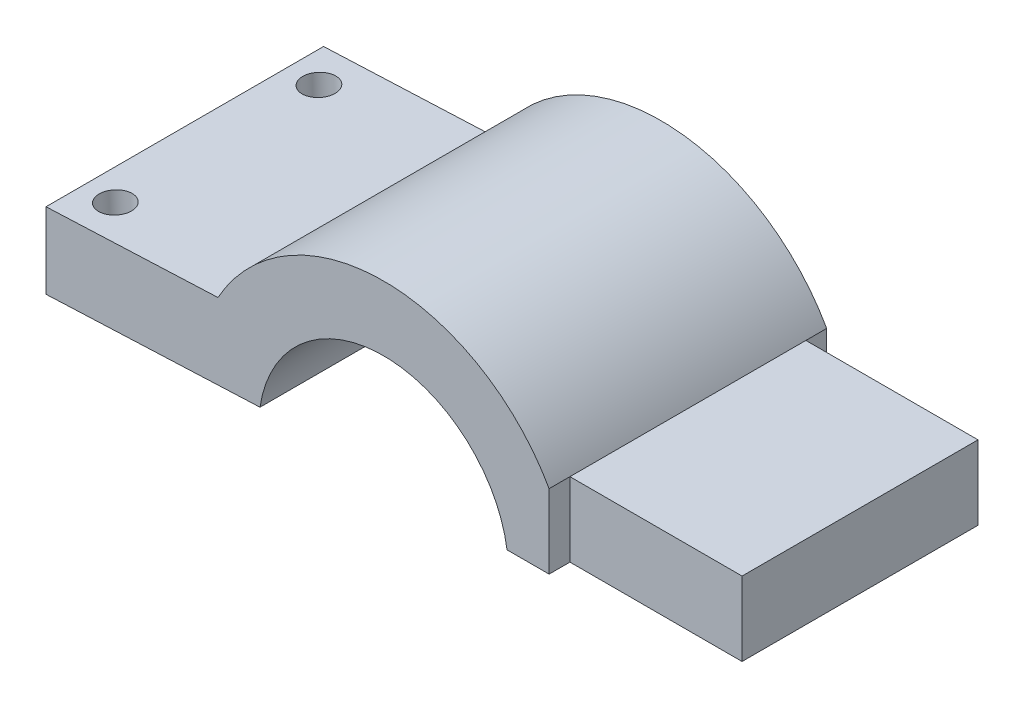
ISO-10303-21;
HEADER;
FILE_DESCRIPTION(('STEP AP214'),'2;1');
FILE_NAME('part.step','',(''),(''),'','','');
FILE_SCHEMA(('AUTOMOTIVE_DESIGN { 1 0 10303 214 1 1 1 1 }'));
ENDSEC;
DATA;
#1=APPLICATION_CONTEXT('core data for automotive mechanical design processes');
#2=APPLICATION_PROTOCOL_DEFINITION('international standard','automotive_design',2000,#1);
#3=PRODUCT_CONTEXT('',#1,'mechanical');
#4=PRODUCT('Part','Part','',(#3));
#5=PRODUCT_RELATED_PRODUCT_CATEGORY('part','',(#4));
#6=PRODUCT_DEFINITION_FORMATION('','',#4);
#7=PRODUCT_DEFINITION_CONTEXT('part definition',#1,'design');
#8=PRODUCT_DEFINITION('design','',#6,#7);
#9=PRODUCT_DEFINITION_SHAPE('','',#8);
#10=(LENGTH_UNIT() NAMED_UNIT(*) SI_UNIT(.MILLI.,.METRE.));
#11=(NAMED_UNIT(*) PLANE_ANGLE_UNIT() SI_UNIT($,.RADIAN.));
#12=(NAMED_UNIT(*) SI_UNIT($,.STERADIAN.) SOLID_ANGLE_UNIT());
#13=UNCERTAINTY_MEASURE_WITH_UNIT(LENGTH_MEASURE(1.E-05),#10,'distance_accuracy_value','');
#14=(GEOMETRIC_REPRESENTATION_CONTEXT(3) GLOBAL_UNCERTAINTY_ASSIGNED_CONTEXT((#13)) GLOBAL_UNIT_ASSIGNED_CONTEXT((#10,
#11,#12)) REPRESENTATION_CONTEXT('',''));
#15=CARTESIAN_POINT('',(0.,0.,0.));
#16=DIRECTION('',(0.,0.,1.));
#17=DIRECTION('',(1.,0.,0.));
#18=AXIS2_PLACEMENT_3D('',#15,#16,#17);
#19=CARTESIAN_POINT('',(3.27236450928483,0.,30.));
#20=DIRECTION('',(0.,1.,0.));
#21=DIRECTION('',(0.,0.,1.));
#22=AXIS2_PLACEMENT_3D('',#19,#20,#21);
#23=PLANE('',#22);
#24=DIRECTION('',(-1.,0.,0.));
#25=VECTOR('',#24,1.);
#26=CARTESIAN_POINT('',(3.27236450928483,0.,27.75));
#27=LINE('',#26,#25);
#28=CARTESIAN_POINT('',(26.4213345864661,0.,27.75));
#29=VERTEX_POINT('',#28);
#30=CARTESIAN_POINT('',(7.81686475463943,0.,27.75));
#31=VERTEX_POINT('',#30);
#32=EDGE_CURVE('E133',#29,#31,#27,.T.);
#33=ORIENTED_EDGE('',*,*,#32,.T.);
#34=DIRECTION('',(0.,0.,1.));
#35=VECTOR('',#34,1.);
#36=CARTESIAN_POINT('',(7.81686475463943,0.,30.));
#37=LINE('',#36,#35);
#38=CARTESIAN_POINT('',(7.81686475463943,0.,30.));
#39=VERTEX_POINT('',#38);
#40=EDGE_CURVE('E190',#31,#39,#37,.T.);
#41=ORIENTED_EDGE('',*,*,#40,.T.);
#42=DIRECTION('',(1.,0.,0.));
#43=VECTOR('',#42,1.);
#44=CARTESIAN_POINT('',(3.27236450928483,0.,30.));
#45=LINE('',#44,#43);
#46=CARTESIAN_POINT('',(3.27236450928483,0.,30.));
#47=VERTEX_POINT('',#46);
#48=EDGE_CURVE('E141',#47,#39,#45,.T.);
#49=ORIENTED_EDGE('',*,*,#48,.F.);
#50=DIRECTION('',(0.,0.,-1.));
#51=VECTOR('',#50,1.);
#52=CARTESIAN_POINT('',(3.27236450928483,0.,30.));
#53=LINE('',#52,#51);
#54=CARTESIAN_POINT('',(3.27236450928483,0.,0.));
#55=VERTEX_POINT('',#54);
#56=EDGE_CURVE('E125',#47,#55,#53,.T.);
#57=ORIENTED_EDGE('',*,*,#56,.T.);
#58=DIRECTION('',(1.,0.,0.));
#59=VECTOR('',#58,1.);
#60=CARTESIAN_POINT('',(3.27236450928483,0.,0.));
#61=LINE('',#60,#59);
#62=CARTESIAN_POINT('',(7.81686475463942,0.,0.));
#63=VERTEX_POINT('',#62);
#64=EDGE_CURVE('E129',#55,#63,#61,.T.);
#65=ORIENTED_EDGE('',*,*,#64,.T.);
#66=DIRECTION('',(0.,0.,1.));
#67=VECTOR('',#66,1.);
#68=CARTESIAN_POINT('',(7.81686475463942,0.,30.));
#69=LINE('',#68,#67);
#70=CARTESIAN_POINT('',(7.81686475463942,0.,2.25000000000001));
#71=VERTEX_POINT('',#70);
#72=EDGE_CURVE('E49',#63,#71,#69,.T.);
#73=ORIENTED_EDGE('',*,*,#72,.T.);
#74=DIRECTION('',(1.,0.,0.));
#75=VECTOR('',#74,1.);
#76=CARTESIAN_POINT('',(3.27236450928482,0.,2.25000000000002));
#77=LINE('',#76,#75);
#78=CARTESIAN_POINT('',(26.4213345864661,0.,2.25));
#79=VERTEX_POINT('',#78);
#80=EDGE_CURVE('E193',#71,#79,#77,.T.);
#81=ORIENTED_EDGE('',*,*,#80,.T.);
#82=DIRECTION('',(0.,0.,-1.));
#83=VECTOR('',#82,1.);
#84=CARTESIAN_POINT('',(26.4213345864661,0.,30.));
#85=LINE('',#84,#83);
#86=EDGE_CURVE('E153',#29,#79,#85,.T.);
#87=ORIENTED_EDGE('',*,*,#86,.F.);
#88=EDGE_LOOP('',(#33,#41,#49,#57,#65,#73,#81,#87));
#89=FACE_BOUND('',#88,.T.);
#90=ADVANCED_FACE('F33',(#89),#23,.F.);
#91=CARTESIAN_POINT('',(26.4213345864661,0.,30.));
#92=DIRECTION('',(-1.,0.,0.));
#93=DIRECTION('',(0.,0.,1.));
#94=AXIS2_PLACEMENT_3D('',#91,#92,#93);
#95=PLANE('',#94);
#96=DIRECTION('',(0.,0.,-1.));
#97=VECTOR('',#96,1.);
#98=CARTESIAN_POINT('',(26.4213345864661,8.,30.));
#99=LINE('',#98,#97);
#100=CARTESIAN_POINT('',(26.4213345864661,8.,27.75));
#101=VERTEX_POINT('',#100);
#102=CARTESIAN_POINT('',(26.4213345864661,8.,2.25));
#103=VERTEX_POINT('',#102);
#104=EDGE_CURVE('E150',#101,#103,#99,.T.);
#105=ORIENTED_EDGE('',*,*,#104,.F.);
#106=DIRECTION('',(0.,1.,0.));
#107=VECTOR('',#106,1.);
#108=CARTESIAN_POINT('',(26.4213345864661,-2.,27.75));
#109=LINE('',#108,#107);
#110=EDGE_CURVE('E181',#29,#101,#109,.T.);
#111=ORIENTED_EDGE('',*,*,#110,.F.);
#112=ORIENTED_EDGE('',*,*,#86,.T.);
#113=DIRECTION('',(0.,1.,0.));
#114=VECTOR('',#113,1.);
#115=CARTESIAN_POINT('',(26.4213345864661,-2.,2.25));
#116=LINE('',#115,#114);
#117=EDGE_CURVE('E184',#79,#103,#116,.T.);
#118=ORIENTED_EDGE('',*,*,#117,.T.);
#119=EDGE_LOOP('',(#105,#111,#112,#118));
#120=FACE_BOUND('',#119,.T.);
#121=ADVANCED_FACE('F247',(#120),#95,.F.);
#122=CARTESIAN_POINT('',(26.4213345864661,8.,30.));
#123=DIRECTION('',(0.,-1.,0.));
#124=DIRECTION('',(1.,0.,0.));
#125=AXIS2_PLACEMENT_3D('',#122,#123,#124);
#126=PLANE('',#125);
#127=DIRECTION('',(0.,0.,-1.));
#128=VECTOR('',#127,1.);
#129=CARTESIAN_POINT('',(7.81686475463943,8.,30.));
#130=LINE('',#129,#128);
#131=CARTESIAN_POINT('',(7.81686475463943,8.,27.75));
#132=VERTEX_POINT('',#131);
#133=CARTESIAN_POINT('',(7.81686475463942,8.,2.25000000000001));
#134=VERTEX_POINT('',#133);
#135=EDGE_CURVE('E148',#132,#134,#130,.T.);
#136=ORIENTED_EDGE('',*,*,#135,.F.);
#137=DIRECTION('',(-1.,0.,0.));
#138=VECTOR('',#137,1.);
#139=CARTESIAN_POINT('',(26.4213345864661,8.,27.75));
#140=LINE('',#139,#138);
#141=EDGE_CURVE('E175',#101,#132,#140,.T.);
#142=ORIENTED_EDGE('',*,*,#141,.F.);
#143=ORIENTED_EDGE('',*,*,#104,.T.);
#144=DIRECTION('',(1.,0.,0.));
#145=VECTOR('',#144,1.);
#146=CARTESIAN_POINT('',(7.81686475463942,8.,2.25000000000001));
#147=LINE('',#146,#145);
#148=EDGE_CURVE('E163',#134,#103,#147,.T.);
#149=ORIENTED_EDGE('',*,*,#148,.F.);
#150=EDGE_LOOP('',(#136,#142,#143,#149));
#151=FACE_BOUND('',#150,.T.);
#152=ADVANCED_FACE('F242',(#151),#126,.F.);
#153=CARTESIAN_POINT('',(-10.0786654135339,-2.,30.));
#154=DIRECTION('',(0.,0.,-1.));
#155=DIRECTION('',(-1.,0.,0.));
#156=AXIS2_PLACEMENT_3D('',#153,#154,#155);
#157=CYLINDRICAL_SURFACE('',#156,20.5);
#158=CARTESIAN_POINT('',(-10.0786654135339,-2.,0.));
#159=DIRECTION('',(0.,0.,1.));
#160=DIRECTION('',(1.,0.,0.));
#161=AXIS2_PLACEMENT_3D('',#158,#159,#160);
#162=CIRCLE('',#161,20.5);
#163=CARTESIAN_POINT('',(7.81686475463942,8.,0.));
#164=VERTEX_POINT('',#163);
#165=CARTESIAN_POINT('',(-27.9741955817071,7.99999999999999,0.));
#166=VERTEX_POINT('',#165);
#167=EDGE_CURVE('E132',#164,#166,#162,.T.);
#168=ORIENTED_EDGE('',*,*,#167,.T.);
#169=DIRECTION('',(0.,0.,-1.));
#170=VECTOR('',#169,1.);
#171=CARTESIAN_POINT('',(-27.9741955817071,7.99999999999999,30.));
#172=LINE('',#171,#170);
#173=CARTESIAN_POINT('',(-27.9741955817071,7.99999999999999,30.));
#174=VERTEX_POINT('',#173);
#175=EDGE_CURVE('E145',#174,#166,#172,.T.);
#176=ORIENTED_EDGE('',*,*,#175,.F.);
#177=CARTESIAN_POINT('',(-10.0786654135339,-2.,30.));
#178=DIRECTION('',(0.,0.,1.));
#179=DIRECTION('',(1.,0.,0.));
#180=AXIS2_PLACEMENT_3D('',#177,#178,#179);
#181=CIRCLE('',#180,20.5);
#182=CARTESIAN_POINT('',(7.81686475463943,8.,30.));
#183=VERTEX_POINT('',#182);
#184=EDGE_CURVE('E199',#183,#174,#181,.T.);
#185=ORIENTED_EDGE('',*,*,#184,.F.);
#186=EDGE_CURVE('E90',#183,#132,#130,.T.);
#187=ORIENTED_EDGE('',*,*,#186,.T.);
#188=ORIENTED_EDGE('',*,*,#135,.T.);
#189=DIRECTION('',(0.,0.,1.));
#190=VECTOR('',#189,1.);
#191=CARTESIAN_POINT('',(7.81686475463942,8.,-4.85709085709799));
#192=LINE('',#191,#190);
#193=EDGE_CURVE('E158',#164,#134,#192,.T.);
#194=ORIENTED_EDGE('',*,*,#193,.F.);
#195=EDGE_LOOP('',(#168,#176,#185,#187,#188,#194));
#196=FACE_BOUND('',#195,.T.);
#197=ADVANCED_FACE('F203',(#196),#157,.T.);
#198=CARTESIAN_POINT('',(-27.9741955817071,7.99999999999999,30.));
#199=DIRECTION('',(0.0429219095580934,-0.99907843019449,0.));
#200=DIRECTION('',(0.99907843019449,0.0429219095580934,0.));
#201=AXIS2_PLACEMENT_3D('',#198,#199,#200);
#202=PLANE('',#201);
#203=CARTESIAN_POINT('',(-43.0615864896743,7.35182303165798,4.));
#204=DIRECTION('',(-0.0429219095580934,0.99907843019449,0.));
#205=DIRECTION('',(0.99907843019449,0.0429219095580934,0.));
#206=AXIS2_PLACEMENT_3D('',#203,#204,#205);
#207=CIRCLE('',#206,1.75);
#208=CARTESIAN_POINT('',(-41.3131992368339,7.42693637338464,4.));
#209=VERTEX_POINT('',#208);
#210=EDGE_CURVE('E170',#209,#209,#207,.T.);
#211=ORIENTED_EDGE('',*,*,#210,.F.);
#212=EDGE_LOOP('',(#211));
#213=FACE_BOUND('',#212,.T.);
#214=CARTESIAN_POINT('',(-43.0615864896743,7.35182303165798,26.));
#215=DIRECTION('',(-0.0429219095580934,0.99907843019449,0.));
#216=DIRECTION('',(-0.99907843019449,-0.0429219095580934,0.));
#217=AXIS2_PLACEMENT_3D('',#214,#215,#216);
#218=CIRCLE('',#217,1.75);
#219=CARTESIAN_POINT('',(-44.8099737425146,7.27670968993131,26.));
#220=VERTEX_POINT('',#219);
#221=EDGE_CURVE('E159',#220,#220,#218,.T.);
#222=ORIENTED_EDGE('',*,*,#221,.F.);
#223=EDGE_LOOP('',(#222));
#224=FACE_BOUND('',#223,.T.);
#225=DIRECTION('',(-0.99907843019449,-0.0429219095580934,0.));
#226=VECTOR('',#225,1.);
#227=CARTESIAN_POINT('',(-27.9741955817071,7.99999999999999,0.));
#228=LINE('',#227,#226);
#229=CARTESIAN_POINT('',(-46.558360995355,7.20159634820465,0.));
#230=VERTEX_POINT('',#229);
#231=EDGE_CURVE('E135',#166,#230,#228,.T.);
#232=ORIENTED_EDGE('',*,*,#231,.T.);
#233=DIRECTION('',(0.,0.,-1.));
#234=VECTOR('',#233,1.);
#235=CARTESIAN_POINT('',(-46.558360995355,7.20159634820465,30.));
#236=LINE('',#235,#234);
#237=CARTESIAN_POINT('',(-46.558360995355,7.20159634820465,30.));
#238=VERTEX_POINT('',#237);
#239=EDGE_CURVE('E120',#238,#230,#236,.T.);
#240=ORIENTED_EDGE('',*,*,#239,.F.);
#241=DIRECTION('',(-0.99907843019449,-0.0429219095580934,0.));
#242=VECTOR('',#241,1.);
#243=CARTESIAN_POINT('',(-27.9741955817071,7.99999999999999,30.));
#244=LINE('',#243,#242);
#245=EDGE_CURVE('E108',#174,#238,#244,.T.);
#246=ORIENTED_EDGE('',*,*,#245,.F.);
#247=ORIENTED_EDGE('',*,*,#175,.T.);
#248=EDGE_LOOP('',(#232,#240,#246,#247));
#249=FACE_BOUND('',#248,.T.);
#250=ADVANCED_FACE('F208',(#213,#224,#249),#202,.F.);
#251=CARTESIAN_POINT('',(-46.558360995355,7.20159634820465,30.));
#252=DIRECTION('',(1.,0.,0.));
#253=DIRECTION('',(0.,0.,-1.));
#254=AXIS2_PLACEMENT_3D('',#251,#252,#253);
#255=PLANE('',#254);
#256=DIRECTION('',(0.,-1.,0.));
#257=VECTOR('',#256,1.);
#258=CARTESIAN_POINT('',(-46.558360995355,7.20159634820465,0.));
#259=LINE('',#258,#257);
#260=CARTESIAN_POINT('',(-46.558360995355,-0.993642206269865,0.));
#261=VERTEX_POINT('',#260);
#262=EDGE_CURVE('E117',#230,#261,#259,.T.);
#263=ORIENTED_EDGE('',*,*,#262,.T.);
#264=DIRECTION('',(0.,0.,-1.));
#265=VECTOR('',#264,1.);
#266=CARTESIAN_POINT('',(-46.558360995355,-0.993642206269865,30.));
#267=LINE('',#266,#265);
#268=CARTESIAN_POINT('',(-46.558360995355,-0.993642206269865,30.));
#269=VERTEX_POINT('',#268);
#270=EDGE_CURVE('E114',#269,#261,#267,.T.);
#271=ORIENTED_EDGE('',*,*,#270,.F.);
#272=DIRECTION('',(0.,-1.,0.));
#273=VECTOR('',#272,1.);
#274=CARTESIAN_POINT('',(-46.558360995355,7.20159634820465,30.));
#275=LINE('',#274,#273);
#276=EDGE_CURVE('E101',#238,#269,#275,.T.);
#277=ORIENTED_EDGE('',*,*,#276,.F.);
#278=ORIENTED_EDGE('',*,*,#239,.T.);
#279=EDGE_LOOP('',(#263,#271,#277,#278));
#280=FACE_BOUND('',#279,.T.);
#281=ADVANCED_FACE('F115',(#280),#255,.F.);
#282=CARTESIAN_POINT('',(-23.4296953363525,0.,30.));
#283=DIRECTION('',(-0.0429219095580936,0.99907843019449,0.));
#284=DIRECTION('',(-0.99907843019449,-0.0429219095580936,0.));
#285=AXIS2_PLACEMENT_3D('',#282,#283,#284);
#286=PLANE('',#285);
#287=CARTESIAN_POINT('',(-42.7101553686845,-0.828317514156611,4.));
#288=DIRECTION('',(-0.0429219095580936,0.99907843019449,0.));
#289=DIRECTION('',(-0.99907843019449,-0.0429219095580936,0.));
#290=AXIS2_PLACEMENT_3D('',#287,#288,#289);
#291=CIRCLE('',#290,1.75);
#292=CARTESIAN_POINT('',(-44.4585426215249,-0.903430855883275,4.));
#293=VERTEX_POINT('',#292);
#294=EDGE_CURVE('E36',#293,#293,#291,.T.);
#295=ORIENTED_EDGE('',*,*,#294,.T.);
#296=EDGE_LOOP('',(#295));
#297=FACE_BOUND('',#296,.T.);
#298=CARTESIAN_POINT('',(-42.7101553686845,-0.828317514156611,26.));
#299=DIRECTION('',(-0.0429219095580936,0.99907843019449,0.));
#300=DIRECTION('',(-0.99907843019449,-0.0429219095580936,0.));
#301=AXIS2_PLACEMENT_3D('',#298,#299,#300);
#302=CIRCLE('',#301,1.75);
#303=CARTESIAN_POINT('',(-44.4585426215249,-0.903430855883275,26.));
#304=VERTEX_POINT('',#303);
#305=EDGE_CURVE('E156',#304,#304,#302,.T.);
#306=ORIENTED_EDGE('',*,*,#305,.T.);
#307=EDGE_LOOP('',(#306));
#308=FACE_BOUND('',#307,.T.);
#309=DIRECTION('',(0.99907843019449,0.0429219095580935,0.));
#310=VECTOR('',#309,1.);
#311=CARTESIAN_POINT('',(-23.4296953363525,0.,0.));
#312=LINE('',#311,#310);
#313=CARTESIAN_POINT('',(-23.4296953363525,0.,0.));
#314=VERTEX_POINT('',#313);
#315=EDGE_CURVE('E138',#261,#314,#312,.T.);
#316=ORIENTED_EDGE('',*,*,#315,.T.);
#317=DIRECTION('',(0.,0.,-1.));
#318=VECTOR('',#317,1.);
#319=CARTESIAN_POINT('',(-23.4296953363525,0.,30.));
#320=LINE('',#319,#318);
#321=CARTESIAN_POINT('',(-23.4296953363525,0.,30.));
#322=VERTEX_POINT('',#321);
#323=EDGE_CURVE('E121',#322,#314,#320,.T.);
#324=ORIENTED_EDGE('',*,*,#323,.F.);
#325=DIRECTION('',(0.99907843019449,0.0429219095580935,0.));
#326=VECTOR('',#325,1.);
#327=CARTESIAN_POINT('',(-23.4296953363525,0.,30.));
#328=LINE('',#327,#326);
#329=EDGE_CURVE('E105',#269,#322,#328,.T.);
#330=ORIENTED_EDGE('',*,*,#329,.F.);
#331=ORIENTED_EDGE('',*,*,#270,.T.);
#332=EDGE_LOOP('',(#316,#324,#330,#331));
#333=FACE_BOUND('',#332,.T.);
#334=ADVANCED_FACE('F123',(#297,#308,#333),#286,.F.);
#335=CARTESIAN_POINT('',(-10.0786654135339,-2.,30.));
#336=DIRECTION('',(0.,0.,-1.));
#337=DIRECTION('',(-1.,0.,0.));
#338=AXIS2_PLACEMENT_3D('',#335,#336,#337);
#339=CYLINDRICAL_SURFACE('',#338,13.5);
#340=CARTESIAN_POINT('',(-10.0786654135339,-2.,0.));
#341=DIRECTION('',(0.,0.,-1.));
#342=DIRECTION('',(1.,0.,0.));
#343=AXIS2_PLACEMENT_3D('',#340,#341,#342);
#344=CIRCLE('',#343,13.5);
#345=EDGE_CURVE('E82',#314,#55,#344,.T.);
#346=ORIENTED_EDGE('',*,*,#345,.T.);
#347=ORIENTED_EDGE('',*,*,#56,.F.);
#348=CARTESIAN_POINT('',(-10.0786654135339,-2.,30.));
#349=DIRECTION('',(0.,0.,-1.));
#350=DIRECTION('',(1.,0.,0.));
#351=AXIS2_PLACEMENT_3D('',#348,#349,#350);
#352=CIRCLE('',#351,13.5);
#353=EDGE_CURVE('E58',#322,#47,#352,.T.);
#354=ORIENTED_EDGE('',*,*,#353,.F.);
#355=ORIENTED_EDGE('',*,*,#323,.T.);
#356=EDGE_LOOP('',(#346,#347,#354,#355));
#357=FACE_BOUND('',#356,.T.);
#358=ADVANCED_FACE('F212',(#357),#339,.F.);
#359=CARTESIAN_POINT('',(-10.0786654135339,-2.,30.));
#360=DIRECTION('',(0.,0.,1.));
#361=DIRECTION('',(1.,0.,0.));
#362=AXIS2_PLACEMENT_3D('',#359,#360,#361);
#363=PLANE('',#362);
#364=DIRECTION('',(0.,-1.,0.));
#365=VECTOR('',#364,1.);
#366=CARTESIAN_POINT('',(7.81686475463943,-2.,30.));
#367=LINE('',#366,#365);
#368=EDGE_CURVE('E11',#183,#39,#367,.T.);
#369=ORIENTED_EDGE('',*,*,#368,.F.);
#370=ORIENTED_EDGE('',*,*,#184,.T.);
#371=ORIENTED_EDGE('',*,*,#245,.T.);
#372=ORIENTED_EDGE('',*,*,#276,.T.);
#373=ORIENTED_EDGE('',*,*,#329,.T.);
#374=ORIENTED_EDGE('',*,*,#353,.T.);
#375=ORIENTED_EDGE('',*,*,#48,.T.);
#376=EDGE_LOOP('',(#369,#370,#371,#372,#373,#374,#375));
#377=FACE_BOUND('',#376,.T.);
#378=ADVANCED_FACE('F103',(#377),#363,.T.);
#379=CARTESIAN_POINT('',(-10.0786654135339,-2.,0.));
#380=DIRECTION('',(0.,0.,1.));
#381=DIRECTION('',(1.,0.,0.));
#382=AXIS2_PLACEMENT_3D('',#379,#380,#381);
#383=PLANE('',#382);
#384=ORIENTED_EDGE('',*,*,#167,.F.);
#385=DIRECTION('',(0.,-1.,0.));
#386=VECTOR('',#385,1.);
#387=CARTESIAN_POINT('',(7.81686475463942,-2.,0.));
#388=LINE('',#387,#386);
#389=EDGE_CURVE('E41',#164,#63,#388,.T.);
#390=ORIENTED_EDGE('',*,*,#389,.T.);
#391=ORIENTED_EDGE('',*,*,#64,.F.);
#392=ORIENTED_EDGE('',*,*,#345,.F.);
#393=ORIENTED_EDGE('',*,*,#315,.F.);
#394=ORIENTED_EDGE('',*,*,#262,.F.);
#395=ORIENTED_EDGE('',*,*,#231,.F.);
#396=EDGE_LOOP('',(#384,#390,#391,#392,#393,#394,#395));
#397=FACE_BOUND('',#396,.T.);
#398=ADVANCED_FACE('F210',(#397),#383,.F.);
#399=CARTESIAN_POINT('',(7.81686475463942,-2.,-4.85709085709799));
#400=DIRECTION('',(-1.,0.,0.));
#401=DIRECTION('',(0.,-1.,0.));
#402=AXIS2_PLACEMENT_3D('',#399,#400,#401);
#403=PLANE('',#402);
#404=ORIENTED_EDGE('',*,*,#389,.F.);
#405=ORIENTED_EDGE('',*,*,#193,.T.);
#406=DIRECTION('',(0.,1.,0.));
#407=VECTOR('',#406,1.);
#408=CARTESIAN_POINT('',(7.81686475463942,-2.,2.25000000000001));
#409=LINE('',#408,#407);
#410=EDGE_CURVE('E178',#71,#134,#409,.T.);
#411=ORIENTED_EDGE('',*,*,#410,.F.);
#412=ORIENTED_EDGE('',*,*,#72,.F.);
#413=EDGE_LOOP('',(#404,#405,#411,#412));
#414=FACE_BOUND('',#413,.T.);
#415=ADVANCED_FACE('F238',(#414),#403,.F.);
#416=CARTESIAN_POINT('',(7.81686475463942,-2.,2.25000000000001));
#417=DIRECTION('',(0.,0.,1.));
#418=DIRECTION('',(1.,0.,0.));
#419=AXIS2_PLACEMENT_3D('',#416,#417,#418);
#420=PLANE('',#419);
#421=ORIENTED_EDGE('',*,*,#410,.T.);
#422=ORIENTED_EDGE('',*,*,#148,.T.);
#423=ORIENTED_EDGE('',*,*,#117,.F.);
#424=ORIENTED_EDGE('',*,*,#80,.F.);
#425=EDGE_LOOP('',(#421,#422,#423,#424));
#426=FACE_BOUND('',#425,.T.);
#427=ADVANCED_FACE('F236',(#426),#420,.F.);
#428=CARTESIAN_POINT('',(26.4213345864661,-2.,27.75));
#429=DIRECTION('',(0.,0.,-1.));
#430=DIRECTION('',(-1.,0.,0.));
#431=AXIS2_PLACEMENT_3D('',#428,#429,#430);
#432=PLANE('',#431);
#433=ORIENTED_EDGE('',*,*,#110,.T.);
#434=ORIENTED_EDGE('',*,*,#141,.T.);
#435=DIRECTION('',(0.,1.,0.));
#436=VECTOR('',#435,1.);
#437=CARTESIAN_POINT('',(7.81686475463943,-2.,27.75));
#438=LINE('',#437,#436);
#439=EDGE_CURVE('E179',#31,#132,#438,.T.);
#440=ORIENTED_EDGE('',*,*,#439,.F.);
#441=ORIENTED_EDGE('',*,*,#32,.F.);
#442=EDGE_LOOP('',(#433,#434,#440,#441));
#443=FACE_BOUND('',#442,.T.);
#444=ADVANCED_FACE('F252',(#443),#432,.F.);
#445=CARTESIAN_POINT('',(7.81686475463943,-2.,27.75));
#446=DIRECTION('',(-1.,0.,0.));
#447=DIRECTION('',(0.,-1.,0.));
#448=AXIS2_PLACEMENT_3D('',#445,#446,#447);
#449=PLANE('',#448);
#450=ORIENTED_EDGE('',*,*,#439,.T.);
#451=ORIENTED_EDGE('',*,*,#186,.F.);
#452=ORIENTED_EDGE('',*,*,#368,.T.);
#453=ORIENTED_EDGE('',*,*,#40,.F.);
#454=EDGE_LOOP('',(#450,#451,#452,#453));
#455=FACE_BOUND('',#454,.T.);
#456=ADVANCED_FACE('F253',(#455),#449,.F.);
#457=CARTESIAN_POINT('',(-42.6323673940933,-2.63896127028693,26.));
#458=DIRECTION('',(-0.0429219095580934,0.99907843019449,0.));
#459=DIRECTION('',(-0.99907843019449,-0.0429219095580934,0.));
#460=AXIS2_PLACEMENT_3D('',#457,#458,#459);
#461=CYLINDRICAL_SURFACE('',#460,1.75);
#462=ORIENTED_EDGE('',*,*,#221,.T.);
#463=EDGE_LOOP('',(#462));
#464=FACE_BOUND('',#463,.T.);
#465=ORIENTED_EDGE('',*,*,#305,.F.);
#466=EDGE_LOOP('',(#465));
#467=FACE_BOUND('',#466,.T.);
#468=ADVANCED_FACE('F255',(#464,#467),#461,.F.);
#469=CARTESIAN_POINT('',(-42.6323673940933,-2.63896127028693,4.));
#470=DIRECTION('',(-0.0429219095580934,0.99907843019449,0.));
#471=DIRECTION('',(-0.99907843019449,-0.0429219095580934,0.));
#472=AXIS2_PLACEMENT_3D('',#469,#470,#471);
#473=CYLINDRICAL_SURFACE('',#472,1.75);
#474=ORIENTED_EDGE('',*,*,#210,.T.);
#475=EDGE_LOOP('',(#474));
#476=FACE_BOUND('',#475,.T.);
#477=ORIENTED_EDGE('',*,*,#294,.F.);
#478=EDGE_LOOP('',(#477));
#479=FACE_BOUND('',#478,.T.);
#480=ADVANCED_FACE('F261',(#476,#479),#473,.F.);
#481=CLOSED_SHELL('',(#90,#121,#152,#197,#250,#281,#334,#358,#378,#398,#415,#427,#444,#456,#468,#480));
#482=MANIFOLD_SOLID_BREP('B2',#481);
#483=ADVANCED_BREP_SHAPE_REPRESENTATION('',(#18,#482),#14);
#484=SHAPE_DEFINITION_REPRESENTATION(#9,#483);
ENDSEC;
END-ISO-10303-21;
